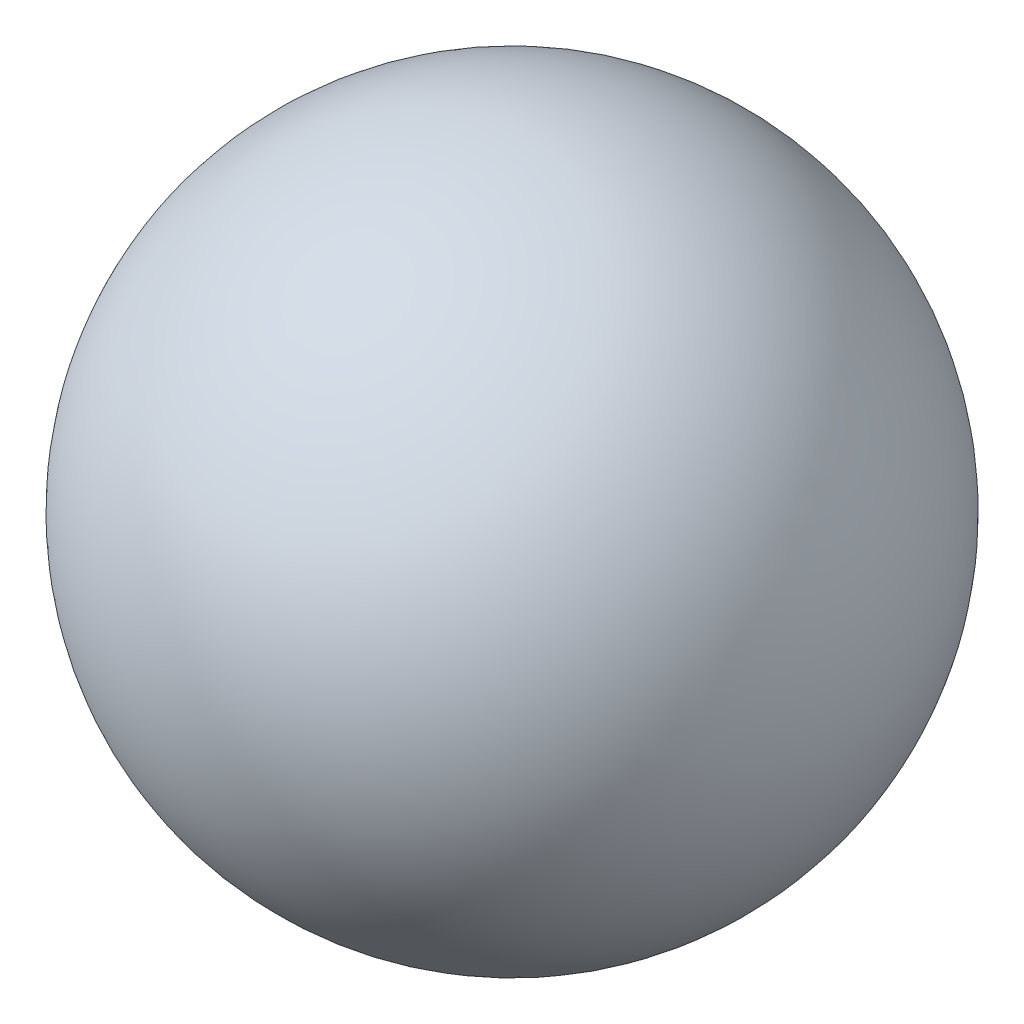
ISO-10303-21;
HEADER;
FILE_DESCRIPTION(('STEP AP214'),'2;1');
FILE_NAME('part.step','',(''),(''),'','','');
FILE_SCHEMA(('AUTOMOTIVE_DESIGN { 1 0 10303 214 1 1 1 1 }'));
ENDSEC;
DATA;
#1=APPLICATION_CONTEXT('core data for automotive mechanical design processes');
#2=APPLICATION_PROTOCOL_DEFINITION('international standard','automotive_design',2000,#1);
#3=PRODUCT_CONTEXT('',#1,'mechanical');
#4=PRODUCT('Part','Part','',(#3));
#5=PRODUCT_RELATED_PRODUCT_CATEGORY('part','',(#4));
#6=PRODUCT_DEFINITION_FORMATION('','',#4);
#7=PRODUCT_DEFINITION_CONTEXT('part definition',#1,'design');
#8=PRODUCT_DEFINITION('design','',#6,#7);
#9=PRODUCT_DEFINITION_SHAPE('','',#8);
#10=(LENGTH_UNIT() NAMED_UNIT(*) SI_UNIT(.MILLI.,.METRE.));
#11=(NAMED_UNIT(*) PLANE_ANGLE_UNIT() SI_UNIT($,.RADIAN.));
#12=(NAMED_UNIT(*) SI_UNIT($,.STERADIAN.) SOLID_ANGLE_UNIT());
#13=UNCERTAINTY_MEASURE_WITH_UNIT(LENGTH_MEASURE(1.E-05),#10,'distance_accuracy_value','');
#14=(GEOMETRIC_REPRESENTATION_CONTEXT(3) GLOBAL_UNCERTAINTY_ASSIGNED_CONTEXT((#13)) GLOBAL_UNIT_ASSIGNED_CONTEXT((#10,
#11,#12)) REPRESENTATION_CONTEXT('',''));
#15=CARTESIAN_POINT('',(0.,0.,0.));
#16=DIRECTION('',(0.,0.,1.));
#17=DIRECTION('',(1.,0.,0.));
#18=AXIS2_PLACEMENT_3D('',#15,#16,#17);
#19=CARTESIAN_POINT('',(1.75,4.95,0.));
#20=DIRECTION('',(1.,0.,0.));
#21=DIRECTION('',(0.,1.,0.));
#22=AXIS2_PLACEMENT_3D('',#19,#20,#21);
#23=SPHERICAL_SURFACE('',#22,0.6);
#24=CARTESIAN_POINT('',(2.35,4.95,0.));
#25=VERTEX_POINT('',#24);
#26=VERTEX_LOOP('',#25);
#27=FACE_BOUND('',#26,.T.);
#28=ADVANCED_FACE('F12',(#27),#23,.T.);
#29=CLOSED_SHELL('',(#28));
#30=MANIFOLD_SOLID_BREP('B1',#29);
#31=ADVANCED_BREP_SHAPE_REPRESENTATION('',(#18,#30),#14);
#32=SHAPE_DEFINITION_REPRESENTATION(#9,#31);
ENDSEC;
END-ISO-10303-21;
